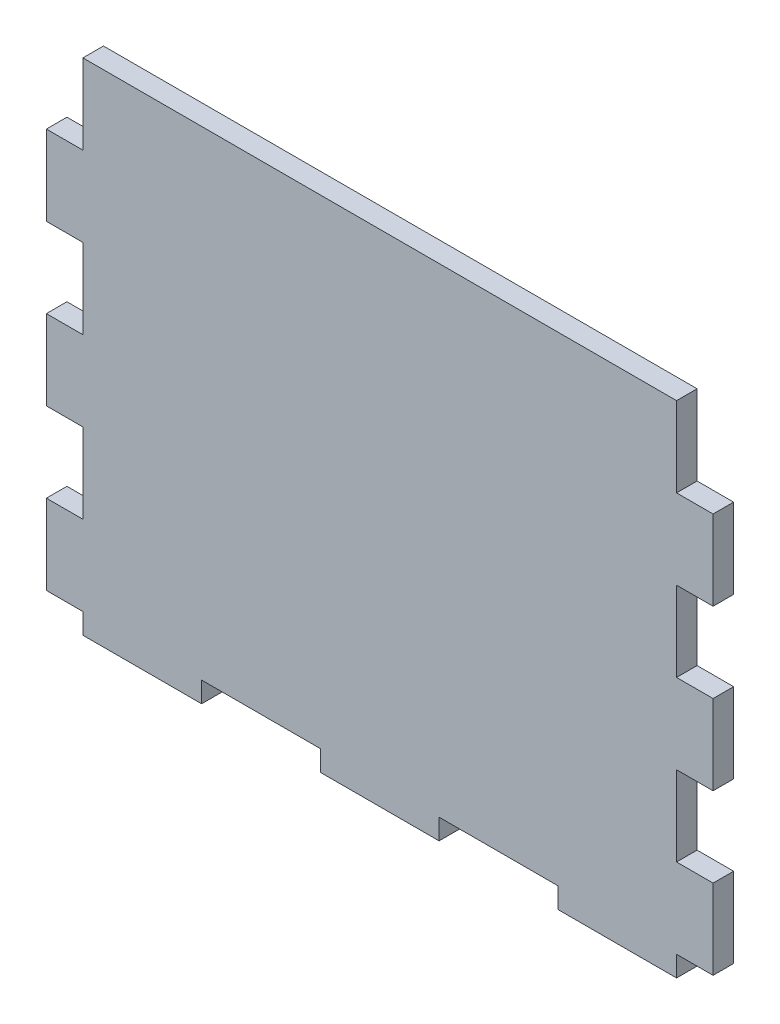
ISO-10303-21;
HEADER;
FILE_DESCRIPTION(('STEP AP214'),'2;1');
FILE_NAME('part.step','',(''),(''),'','','');
FILE_SCHEMA(('AUTOMOTIVE_DESIGN { 1 0 10303 214 1 1 1 1 }'));
ENDSEC;
DATA;
#1=APPLICATION_CONTEXT('core data for automotive mechanical design processes');
#2=APPLICATION_PROTOCOL_DEFINITION('international standard','automotive_design',2000,#1);
#3=PRODUCT_CONTEXT('',#1,'mechanical');
#4=PRODUCT('Part','Part','',(#3));
#5=PRODUCT_RELATED_PRODUCT_CATEGORY('part','',(#4));
#6=PRODUCT_DEFINITION_FORMATION('','',#4);
#7=PRODUCT_DEFINITION_CONTEXT('part definition',#1,'design');
#8=PRODUCT_DEFINITION('design','',#6,#7);
#9=PRODUCT_DEFINITION_SHAPE('','',#8);
#10=(LENGTH_UNIT() NAMED_UNIT(*) SI_UNIT(.MILLI.,.METRE.));
#11=(NAMED_UNIT(*) PLANE_ANGLE_UNIT() SI_UNIT($,.RADIAN.));
#12=(NAMED_UNIT(*) SI_UNIT($,.STERADIAN.) SOLID_ANGLE_UNIT());
#13=UNCERTAINTY_MEASURE_WITH_UNIT(LENGTH_MEASURE(1.E-05),#10,'distance_accuracy_value','');
#14=(GEOMETRIC_REPRESENTATION_CONTEXT(3) GLOBAL_UNCERTAINTY_ASSIGNED_CONTEXT((#13)) GLOBAL_UNIT_ASSIGNED_CONTEXT((#10,
#11,#12)) REPRESENTATION_CONTEXT('',''));
#15=CARTESIAN_POINT('',(0.,0.,0.));
#16=DIRECTION('',(0.,0.,1.));
#17=DIRECTION('',(1.,0.,0.));
#18=AXIS2_PLACEMENT_3D('',#15,#16,#17);
#19=CARTESIAN_POINT('',(0.,0.,2.25));
#20=DIRECTION('',(1.,0.,0.));
#21=DIRECTION('',(0.,0.,-1.));
#22=AXIS2_PLACEMENT_3D('',#19,#20,#21);
#23=PLANE('',#22);
#24=DIRECTION('',(0.,0.,1.));
#25=VECTOR('',#24,1.);
#26=CARTESIAN_POINT('',(-1.20058714961002E-13,35.,-13.1932748019588));
#27=LINE('',#26,#25);
#28=CARTESIAN_POINT('',(-1.20058714961002E-13,35.,0.));
#29=VERTEX_POINT('',#28);
#30=CARTESIAN_POINT('',(0.,35.,2.25));
#31=VERTEX_POINT('',#30);
#32=EDGE_CURVE('E1093',#29,#31,#27,.T.);
#33=ORIENTED_EDGE('',*,*,#32,.F.);
#34=DIRECTION('',(0.,-1.,0.));
#35=VECTOR('',#34,1.);
#36=CARTESIAN_POINT('',(0.,0.,0.));
#37=LINE('',#36,#35);
#38=CARTESIAN_POINT('',(0.,26.25,0.));
#39=VERTEX_POINT('',#38);
#40=EDGE_CURVE('E294',#29,#39,#37,.T.);
#41=ORIENTED_EDGE('',*,*,#40,.T.);
#42=DIRECTION('',(0.,0.,1.));
#43=VECTOR('',#42,1.);
#44=CARTESIAN_POINT('',(0.,26.25,-13.1932748019588));
#45=LINE('',#44,#43);
#46=CARTESIAN_POINT('',(0.,26.25,2.25));
#47=VERTEX_POINT('',#46);
#48=EDGE_CURVE('E315',#39,#47,#45,.T.);
#49=ORIENTED_EDGE('',*,*,#48,.T.);
#50=DIRECTION('',(0.,-1.,0.));
#51=VECTOR('',#50,1.);
#52=CARTESIAN_POINT('',(0.,0.,2.25));
#53=LINE('',#52,#51);
#54=EDGE_CURVE('E56',#31,#47,#53,.T.);
#55=ORIENTED_EDGE('',*,*,#54,.F.);
#56=EDGE_LOOP('',(#33,#41,#49,#55));
#57=FACE_BOUND('',#56,.T.);
#58=ADVANCED_FACE('F39',(#57),#23,.F.);
#59=CARTESIAN_POINT('',(0.,0.,2.25));
#60=DIRECTION('',(0.,1.,0.));
#61=DIRECTION('',(0.,0.,1.));
#62=AXIS2_PLACEMENT_3D('',#59,#60,#61);
#63=PLANE('',#62);
#64=DIRECTION('',(0.,0.,1.));
#65=VECTOR('',#64,1.);
#66=CARTESIAN_POINT('',(39.,0.,-13.1932748019588));
#67=LINE('',#66,#65);
#68=CARTESIAN_POINT('',(39.,0.,0.));
#69=VERTEX_POINT('',#68);
#70=CARTESIAN_POINT('',(39.,0.,2.25));
#71=VERTEX_POINT('',#70);
#72=EDGE_CURVE('E449',#69,#71,#67,.T.);
#73=ORIENTED_EDGE('',*,*,#72,.F.);
#74=DIRECTION('',(1.,0.,0.));
#75=VECTOR('',#74,1.);
#76=CARTESIAN_POINT('',(0.,0.,0.));
#77=LINE('',#76,#75);
#78=CARTESIAN_POINT('',(52.,0.,0.));
#79=VERTEX_POINT('',#78);
#80=EDGE_CURVE('E293',#69,#79,#77,.T.);
#81=ORIENTED_EDGE('',*,*,#80,.T.);
#82=DIRECTION('',(0.,0.,1.));
#83=VECTOR('',#82,1.);
#84=CARTESIAN_POINT('',(52.,0.,-13.1932748019588));
#85=LINE('',#84,#83);
#86=CARTESIAN_POINT('',(52.,0.,2.25));
#87=VERTEX_POINT('',#86);
#88=EDGE_CURVE('E446',#79,#87,#85,.T.);
#89=ORIENTED_EDGE('',*,*,#88,.T.);
#90=DIRECTION('',(1.,0.,0.));
#91=VECTOR('',#90,1.);
#92=CARTESIAN_POINT('',(0.,0.,2.25));
#93=LINE('',#92,#91);
#94=EDGE_CURVE('E433',#71,#87,#93,.T.);
#95=ORIENTED_EDGE('',*,*,#94,.F.);
#96=EDGE_LOOP('',(#73,#81,#89,#95));
#97=FACE_BOUND('',#96,.T.);
#98=ADVANCED_FACE('F445',(#97),#63,.F.);
#99=CARTESIAN_POINT('',(65.,0.,2.25));
#100=DIRECTION('',(-1.,0.,0.));
#101=DIRECTION('',(0.,0.,1.));
#102=AXIS2_PLACEMENT_3D('',#99,#100,#101);
#103=PLANE('',#102);
#104=DIRECTION('',(0.,0.,1.));
#105=VECTOR('',#104,1.);
#106=CARTESIAN_POINT('',(65.,8.75000000000001,-13.1932748019588));
#107=LINE('',#106,#105);
#108=CARTESIAN_POINT('',(65.,8.75000000000001,0.));
#109=VERTEX_POINT('',#108);
#110=CARTESIAN_POINT('',(65.,8.75000000000001,2.25));
#111=VERTEX_POINT('',#110);
#112=EDGE_CURVE('E599',#109,#111,#107,.T.);
#113=ORIENTED_EDGE('',*,*,#112,.F.);
#114=DIRECTION('',(0.,1.,0.));
#115=VECTOR('',#114,1.);
#116=CARTESIAN_POINT('',(65.,0.,0.));
#117=LINE('',#116,#115);
#118=CARTESIAN_POINT('',(65.,17.5,0.));
#119=VERTEX_POINT('',#118);
#120=EDGE_CURVE('E485',#109,#119,#117,.T.);
#121=ORIENTED_EDGE('',*,*,#120,.T.);
#122=DIRECTION('',(0.,0.,1.));
#123=VECTOR('',#122,1.);
#124=CARTESIAN_POINT('',(65.,17.5,-13.1932748019588));
#125=LINE('',#124,#123);
#126=CARTESIAN_POINT('',(65.,17.5,2.25));
#127=VERTEX_POINT('',#126);
#128=EDGE_CURVE('E359',#119,#127,#125,.T.);
#129=ORIENTED_EDGE('',*,*,#128,.T.);
#130=DIRECTION('',(0.,1.,0.));
#131=VECTOR('',#130,1.);
#132=CARTESIAN_POINT('',(65.,0.,2.25));
#133=LINE('',#132,#131);
#134=EDGE_CURVE('E47',#111,#127,#133,.T.);
#135=ORIENTED_EDGE('',*,*,#134,.F.);
#136=EDGE_LOOP('',(#113,#121,#129,#135));
#137=FACE_BOUND('',#136,.T.);
#138=ADVANCED_FACE('F528',(#137),#103,.F.);
#139=CARTESIAN_POINT('',(0.,52.5,0.));
#140=VERTEX_POINT('',#139);
#141=CARTESIAN_POINT('',(0.,43.75,0.));
#142=VERTEX_POINT('',#141);
#143=EDGE_CURVE('E289',#140,#142,#37,.T.);
#144=ORIENTED_EDGE('',*,*,#143,.T.);
#145=DIRECTION('',(0.,0.,1.));
#146=VECTOR('',#145,1.);
#147=CARTESIAN_POINT('',(-1.20058714961002E-13,43.75,-13.1932748019588));
#148=LINE('',#147,#146);
#149=CARTESIAN_POINT('',(0.,43.75,2.25));
#150=VERTEX_POINT('',#149);
#151=EDGE_CURVE('E64',#142,#150,#148,.T.);
#152=ORIENTED_EDGE('',*,*,#151,.T.);
#153=CARTESIAN_POINT('',(0.,52.5,2.25));
#154=VERTEX_POINT('',#153);
#155=EDGE_CURVE('E298',#154,#150,#53,.T.);
#156=ORIENTED_EDGE('',*,*,#155,.F.);
#157=DIRECTION('',(0.,0.,1.));
#158=VECTOR('',#157,1.);
#159=CARTESIAN_POINT('',(0.,52.5,-13.1932748019588));
#160=LINE('',#159,#158);
#161=EDGE_CURVE('E279',#140,#154,#160,.T.);
#162=ORIENTED_EDGE('',*,*,#161,.F.);
#163=EDGE_LOOP('',(#144,#152,#156,#162));
#164=FACE_BOUND('',#163,.T.);
#165=ADVANCED_FACE('F297',(#164),#23,.F.);
#166=DIRECTION('',(0.,0.,1.));
#167=VECTOR('',#166,1.);
#168=CARTESIAN_POINT('',(0.,17.5,-13.1932748019588));
#169=LINE('',#168,#167);
#170=CARTESIAN_POINT('',(0.,17.5,0.));
#171=VERTEX_POINT('',#170);
#172=CARTESIAN_POINT('',(0.,17.5,2.25));
#173=VERTEX_POINT('',#172);
#174=EDGE_CURVE('E312',#171,#173,#169,.T.);
#175=ORIENTED_EDGE('',*,*,#174,.F.);
#176=CARTESIAN_POINT('',(0.,8.75000000000001,0.));
#177=VERTEX_POINT('',#176);
#178=EDGE_CURVE('E296',#171,#177,#37,.T.);
#179=ORIENTED_EDGE('',*,*,#178,.T.);
#180=DIRECTION('',(0.,0.,1.));
#181=VECTOR('',#180,1.);
#182=CARTESIAN_POINT('',(0.,8.75000000000001,-13.1932748019588));
#183=LINE('',#182,#181);
#184=CARTESIAN_POINT('',(0.,8.75000000000001,2.25));
#185=VERTEX_POINT('',#184);
#186=EDGE_CURVE('E361',#177,#185,#183,.T.);
#187=ORIENTED_EDGE('',*,*,#186,.T.);
#188=EDGE_CURVE('E429',#173,#185,#53,.T.);
#189=ORIENTED_EDGE('',*,*,#188,.F.);
#190=EDGE_LOOP('',(#175,#179,#187,#189));
#191=FACE_BOUND('',#190,.T.);
#192=ADVANCED_FACE('F524',(#191),#23,.F.);
#193=CARTESIAN_POINT('',(13.,0.,0.));
#194=VERTEX_POINT('',#193);
#195=CARTESIAN_POINT('',(26.,0.,0.));
#196=VERTEX_POINT('',#195);
#197=EDGE_CURVE('E436',#194,#196,#77,.T.);
#198=ORIENTED_EDGE('',*,*,#197,.T.);
#199=DIRECTION('',(0.,0.,1.));
#200=VECTOR('',#199,1.);
#201=CARTESIAN_POINT('',(26.,0.,-13.1932748019588));
#202=LINE('',#201,#200);
#203=CARTESIAN_POINT('',(26.,0.,2.25));
#204=VERTEX_POINT('',#203);
#205=EDGE_CURVE('E576',#196,#204,#202,.T.);
#206=ORIENTED_EDGE('',*,*,#205,.T.);
#207=CARTESIAN_POINT('',(13.,0.,2.25));
#208=VERTEX_POINT('',#207);
#209=EDGE_CURVE('E432',#208,#204,#93,.T.);
#210=ORIENTED_EDGE('',*,*,#209,.F.);
#211=DIRECTION('',(0.,0.,1.));
#212=VECTOR('',#211,1.);
#213=CARTESIAN_POINT('',(13.,0.,-13.1932748019588));
#214=LINE('',#213,#212);
#215=EDGE_CURVE('E310',#194,#208,#214,.T.);
#216=ORIENTED_EDGE('',*,*,#215,.F.);
#217=EDGE_LOOP('',(#198,#206,#210,#216));
#218=FACE_BOUND('',#217,.T.);
#219=ADVANCED_FACE('F529',(#218),#63,.F.);
#220=DIRECTION('',(0.,0.,1.));
#221=VECTOR('',#220,1.);
#222=CARTESIAN_POINT('',(65.,26.25,-13.1932748019588));
#223=LINE('',#222,#221);
#224=CARTESIAN_POINT('',(65.,26.25,0.));
#225=VERTEX_POINT('',#224);
#226=CARTESIAN_POINT('',(65.,26.25,2.25));
#227=VERTEX_POINT('',#226);
#228=EDGE_CURVE('E384',#225,#227,#223,.T.);
#229=ORIENTED_EDGE('',*,*,#228,.F.);
#230=CARTESIAN_POINT('',(65.,35.,0.));
#231=VERTEX_POINT('',#230);
#232=EDGE_CURVE('E440',#225,#231,#117,.T.);
#233=ORIENTED_EDGE('',*,*,#232,.T.);
#234=DIRECTION('',(0.,0.,1.));
#235=VECTOR('',#234,1.);
#236=CARTESIAN_POINT('',(65.,35.,-13.1932748019588));
#237=LINE('',#236,#235);
#238=CARTESIAN_POINT('',(65.,35.,2.25));
#239=VERTEX_POINT('',#238);
#240=EDGE_CURVE('E405',#231,#239,#237,.T.);
#241=ORIENTED_EDGE('',*,*,#240,.T.);
#242=EDGE_CURVE('E505',#227,#239,#133,.T.);
#243=ORIENTED_EDGE('',*,*,#242,.F.);
#244=EDGE_LOOP('',(#229,#233,#241,#243));
#245=FACE_BOUND('',#244,.T.);
#246=ADVANCED_FACE('F495',(#245),#103,.F.);
#247=CARTESIAN_POINT('',(65.,43.75,0.));
#248=VERTEX_POINT('',#247);
#249=CARTESIAN_POINT('',(65.,52.5,0.));
#250=VERTEX_POINT('',#249);
#251=EDGE_CURVE('E435',#248,#250,#117,.T.);
#252=ORIENTED_EDGE('',*,*,#251,.T.);
#253=DIRECTION('',(0.,0.,1.));
#254=VECTOR('',#253,1.);
#255=CARTESIAN_POINT('',(65.0000000000002,52.5,-13.1932748019588));
#256=LINE('',#255,#254);
#257=CARTESIAN_POINT('',(65.0000000000002,52.5,2.25));
#258=VERTEX_POINT('',#257);
#259=EDGE_CURVE('E282',#250,#258,#256,.T.);
#260=ORIENTED_EDGE('',*,*,#259,.T.);
#261=CARTESIAN_POINT('',(65.,43.75,2.25));
#262=VERTEX_POINT('',#261);
#263=EDGE_CURVE('E49',#262,#258,#133,.T.);
#264=ORIENTED_EDGE('',*,*,#263,.F.);
#265=DIRECTION('',(0.,0.,1.));
#266=VECTOR('',#265,1.);
#267=CARTESIAN_POINT('',(65.,43.75,-13.1932748019588));
#268=LINE('',#267,#266);
#269=EDGE_CURVE('E406',#248,#262,#268,.T.);
#270=ORIENTED_EDGE('',*,*,#269,.F.);
#271=EDGE_LOOP('',(#252,#260,#264,#270));
#272=FACE_BOUND('',#271,.T.);
#273=ADVANCED_FACE('F507',(#272),#103,.F.);
#274=CARTESIAN_POINT('',(-4.,0.,0.));
#275=VERTEX_POINT('',#274);
#276=CARTESIAN_POINT('',(0.,0.,0.));
#277=VERTEX_POINT('',#276);
#278=EDGE_CURVE('E434',#275,#277,#77,.T.);
#279=ORIENTED_EDGE('',*,*,#278,.T.);
#280=DIRECTION('',(0.,0.,1.));
#281=VECTOR('',#280,1.);
#282=CARTESIAN_POINT('',(0.,0.,-13.1932748019588));
#283=LINE('',#282,#281);
#284=CARTESIAN_POINT('',(0.,0.,2.25));
#285=VERTEX_POINT('',#284);
#286=EDGE_CURVE('E331',#277,#285,#283,.T.);
#287=ORIENTED_EDGE('',*,*,#286,.T.);
#288=CARTESIAN_POINT('',(-4.,0.,2.25));
#289=VERTEX_POINT('',#288);
#290=EDGE_CURVE('E430',#289,#285,#93,.T.);
#291=ORIENTED_EDGE('',*,*,#290,.F.);
#292=DIRECTION('',(0.,0.,1.));
#293=VECTOR('',#292,1.);
#294=CARTESIAN_POINT('',(-4.,0.,-13.1932748019588));
#295=LINE('',#294,#293);
#296=EDGE_CURVE('E356',#275,#289,#295,.T.);
#297=ORIENTED_EDGE('',*,*,#296,.F.);
#298=EDGE_LOOP('',(#279,#287,#291,#297));
#299=FACE_BOUND('',#298,.T.);
#300=ADVANCED_FACE('F530',(#299),#63,.F.);
#301=CARTESIAN_POINT('',(65.,-2.25,0.));
#302=VERTEX_POINT('',#301);
#303=CARTESIAN_POINT('',(65.,0.,0.));
#304=VERTEX_POINT('',#303);
#305=EDGE_CURVE('E42',#302,#304,#117,.T.);
#306=ORIENTED_EDGE('',*,*,#305,.T.);
#307=DIRECTION('',(0.,0.,1.));
#308=VECTOR('',#307,1.);
#309=CARTESIAN_POINT('',(65.,0.,-13.1932748019588));
#310=LINE('',#309,#308);
#311=CARTESIAN_POINT('',(65.,0.,2.25));
#312=VERTEX_POINT('',#311);
#313=EDGE_CURVE('E471',#304,#312,#310,.T.);
#314=ORIENTED_EDGE('',*,*,#313,.T.);
#315=CARTESIAN_POINT('',(65.,-2.25,2.25));
#316=VERTEX_POINT('',#315);
#317=EDGE_CURVE('E11',#316,#312,#133,.T.);
#318=ORIENTED_EDGE('',*,*,#317,.F.);
#319=DIRECTION('',(0.,0.,1.));
#320=VECTOR('',#319,1.);
#321=CARTESIAN_POINT('',(65.,-2.25,-13.1932748019588));
#322=LINE('',#321,#320);
#323=EDGE_CURVE('E462',#302,#316,#322,.T.);
#324=ORIENTED_EDGE('',*,*,#323,.F.);
#325=EDGE_LOOP('',(#306,#314,#318,#324));
#326=FACE_BOUND('',#325,.T.);
#327=ADVANCED_FACE('F867',(#326),#103,.F.);
#328=CARTESIAN_POINT('',(0.,0.,2.25));
#329=DIRECTION('',(0.,0.,-1.));
#330=DIRECTION('',(-1.,0.,0.));
#331=AXIS2_PLACEMENT_3D('',#328,#329,#330);
#332=PLANE('',#331);
#333=ORIENTED_EDGE('',*,*,#263,.T.);
#334=DIRECTION('',(-1.,0.,0.));
#335=VECTOR('',#334,1.);
#336=CARTESIAN_POINT('',(69.0000000000001,52.5,2.25));
#337=LINE('',#336,#335);
#338=EDGE_CURVE('E286',#258,#154,#337,.T.);
#339=ORIENTED_EDGE('',*,*,#338,.T.);
#340=ORIENTED_EDGE('',*,*,#155,.T.);
#341=DIRECTION('',(-1.,0.,0.));
#342=VECTOR('',#341,1.);
#343=CARTESIAN_POINT('',(-1.20058714961002E-13,43.75,2.25));
#344=LINE('',#343,#342);
#345=CARTESIAN_POINT('',(-4.00000000000015,43.75,2.25));
#346=VERTEX_POINT('',#345);
#347=EDGE_CURVE('E1101',#150,#346,#344,.T.);
#348=ORIENTED_EDGE('',*,*,#347,.T.);
#349=DIRECTION('',(0.,1.,0.));
#350=VECTOR('',#349,1.);
#351=CARTESIAN_POINT('',(-4.00000000000012,35.,2.25));
#352=LINE('',#351,#350);
#353=CARTESIAN_POINT('',(-4.00000000000012,35.,2.25));
#354=VERTEX_POINT('',#353);
#355=EDGE_CURVE('E1107',#354,#346,#352,.T.);
#356=ORIENTED_EDGE('',*,*,#355,.F.);
#357=DIRECTION('',(-1.,0.,0.));
#358=VECTOR('',#357,1.);
#359=CARTESIAN_POINT('',(-1.20058714961002E-13,35.,2.25));
#360=LINE('',#359,#358);
#361=EDGE_CURVE('E1105',#31,#354,#360,.T.);
#362=ORIENTED_EDGE('',*,*,#361,.F.);
#363=ORIENTED_EDGE('',*,*,#54,.T.);
#364=DIRECTION('',(-1.,0.,0.));
#365=VECTOR('',#364,1.);
#366=CARTESIAN_POINT('',(0.,26.25,2.25));
#367=LINE('',#366,#365);
#368=CARTESIAN_POINT('',(-4.00000000000009,26.25,2.25));
#369=VERTEX_POINT('',#368);
#370=EDGE_CURVE('E322',#47,#369,#367,.T.);
#371=ORIENTED_EDGE('',*,*,#370,.T.);
#372=DIRECTION('',(0.,1.,0.));
#373=VECTOR('',#372,1.);
#374=CARTESIAN_POINT('',(-4.,0.,2.25));
#375=LINE('',#374,#373);
#376=CARTESIAN_POINT('',(-4.00000000000006,17.5,2.25));
#377=VERTEX_POINT('',#376);
#378=EDGE_CURVE('E311',#377,#369,#375,.T.);
#379=ORIENTED_EDGE('',*,*,#378,.F.);
#380=DIRECTION('',(-1.,0.,0.));
#381=VECTOR('',#380,1.);
#382=CARTESIAN_POINT('',(0.,17.5,2.25));
#383=LINE('',#382,#381);
#384=EDGE_CURVE('E316',#173,#377,#383,.T.);
#385=ORIENTED_EDGE('',*,*,#384,.F.);
#386=ORIENTED_EDGE('',*,*,#188,.T.);
#387=DIRECTION('',(-1.,0.,0.));
#388=VECTOR('',#387,1.);
#389=CARTESIAN_POINT('',(0.,8.75000000000001,2.25));
#390=LINE('',#389,#388);
#391=CARTESIAN_POINT('',(-4.00000000000003,8.75,2.25));
#392=VERTEX_POINT('',#391);
#393=EDGE_CURVE('E365',#185,#392,#390,.T.);
#394=ORIENTED_EDGE('',*,*,#393,.T.);
#395=DIRECTION('',(0.,1.,0.));
#396=VECTOR('',#395,1.);
#397=CARTESIAN_POINT('',(-4.,0.,2.25));
#398=LINE('',#397,#396);
#399=EDGE_CURVE('E360',#289,#392,#398,.T.);
#400=ORIENTED_EDGE('',*,*,#399,.F.);
#401=ORIENTED_EDGE('',*,*,#290,.T.);
#402=DIRECTION('',(0.,-1.,0.));
#403=VECTOR('',#402,1.);
#404=CARTESIAN_POINT('',(0.,0.,2.25));
#405=LINE('',#404,#403);
#406=CARTESIAN_POINT('',(0.,-2.25,2.25));
#407=VERTEX_POINT('',#406);
#408=EDGE_CURVE('E333',#285,#407,#405,.T.);
#409=ORIENTED_EDGE('',*,*,#408,.T.);
#410=DIRECTION('',(1.,0.,0.));
#411=VECTOR('',#410,1.);
#412=CARTESIAN_POINT('',(0.,-2.25,2.25));
#413=LINE('',#412,#411);
#414=CARTESIAN_POINT('',(13.,-2.25,2.25));
#415=VERTEX_POINT('',#414);
#416=EDGE_CURVE('E347',#407,#415,#413,.T.);
#417=ORIENTED_EDGE('',*,*,#416,.T.);
#418=DIRECTION('',(0.,-1.,0.));
#419=VECTOR('',#418,1.);
#420=CARTESIAN_POINT('',(13.,0.,2.25));
#421=LINE('',#420,#419);
#422=EDGE_CURVE('E337',#208,#415,#421,.T.);
#423=ORIENTED_EDGE('',*,*,#422,.F.);
#424=ORIENTED_EDGE('',*,*,#209,.T.);
#425=DIRECTION('',(0.,-1.,0.));
#426=VECTOR('',#425,1.);
#427=CARTESIAN_POINT('',(26.,0.,2.25));
#428=LINE('',#427,#426);
#429=CARTESIAN_POINT('',(26.,-2.25,2.25));
#430=VERTEX_POINT('',#429);
#431=EDGE_CURVE('E571',#204,#430,#428,.T.);
#432=ORIENTED_EDGE('',*,*,#431,.T.);
#433=DIRECTION('',(1.,0.,0.));
#434=VECTOR('',#433,1.);
#435=CARTESIAN_POINT('',(26.,-2.25,2.25));
#436=LINE('',#435,#434);
#437=CARTESIAN_POINT('',(39.,-2.25,2.25));
#438=VERTEX_POINT('',#437);
#439=EDGE_CURVE('E581',#430,#438,#436,.T.);
#440=ORIENTED_EDGE('',*,*,#439,.T.);
#441=DIRECTION('',(0.,-1.,0.));
#442=VECTOR('',#441,1.);
#443=CARTESIAN_POINT('',(39.,0.,2.25));
#444=LINE('',#443,#442);
#445=EDGE_CURVE('E479',#71,#438,#444,.T.);
#446=ORIENTED_EDGE('',*,*,#445,.F.);
#447=ORIENTED_EDGE('',*,*,#94,.T.);
#448=DIRECTION('',(0.,-1.,0.));
#449=VECTOR('',#448,1.);
#450=CARTESIAN_POINT('',(52.,0.,2.25));
#451=LINE('',#450,#449);
#452=CARTESIAN_POINT('',(52.,-2.25,2.25));
#453=VERTEX_POINT('',#452);
#454=EDGE_CURVE('E457',#87,#453,#451,.T.);
#455=ORIENTED_EDGE('',*,*,#454,.T.);
#456=DIRECTION('',(1.,0.,0.));
#457=VECTOR('',#456,1.);
#458=CARTESIAN_POINT('',(52.,-2.25,2.25));
#459=LINE('',#458,#457);
#460=EDGE_CURVE('E469',#453,#316,#459,.T.);
#461=ORIENTED_EDGE('',*,*,#460,.T.);
#462=ORIENTED_EDGE('',*,*,#317,.T.);
#463=DIRECTION('',(1.,0.,0.));
#464=VECTOR('',#463,1.);
#465=CARTESIAN_POINT('',(0.,0.,2.25));
#466=LINE('',#465,#464);
#467=CARTESIAN_POINT('',(69.,0.,2.25));
#468=VERTEX_POINT('',#467);
#469=EDGE_CURVE('E605',#312,#468,#466,.T.);
#470=ORIENTED_EDGE('',*,*,#469,.T.);
#471=DIRECTION('',(0.,1.,0.));
#472=VECTOR('',#471,1.);
#473=CARTESIAN_POINT('',(69.,-2.18872539140388E-13,2.25));
#474=LINE('',#473,#472);
#475=CARTESIAN_POINT('',(69.,8.75,2.25));
#476=VERTEX_POINT('',#475);
#477=EDGE_CURVE('E608',#468,#476,#474,.T.);
#478=ORIENTED_EDGE('',*,*,#477,.T.);
#479=DIRECTION('',(1.,0.,0.));
#480=VECTOR('',#479,1.);
#481=CARTESIAN_POINT('',(0.,8.75000000000012,2.25));
#482=LINE('',#481,#480);
#483=EDGE_CURVE('E592',#111,#476,#482,.T.);
#484=ORIENTED_EDGE('',*,*,#483,.F.);
#485=ORIENTED_EDGE('',*,*,#134,.T.);
#486=DIRECTION('',(1.,0.,0.));
#487=VECTOR('',#486,1.);
#488=CARTESIAN_POINT('',(0.,17.4999999999998,2.25));
#489=LINE('',#488,#487);
#490=CARTESIAN_POINT('',(69.0000000000001,17.5,2.25));
#491=VERTEX_POINT('',#490);
#492=EDGE_CURVE('E392',#127,#491,#489,.T.);
#493=ORIENTED_EDGE('',*,*,#492,.T.);
#494=DIRECTION('',(0.,1.,0.));
#495=VECTOR('',#494,1.);
#496=CARTESIAN_POINT('',(69.,-2.18872539140388E-13,2.25));
#497=LINE('',#496,#495);
#498=CARTESIAN_POINT('',(69.0000000000001,26.25,2.25));
#499=VERTEX_POINT('',#498);
#500=EDGE_CURVE('E395',#491,#499,#497,.T.);
#501=ORIENTED_EDGE('',*,*,#500,.T.);
#502=DIRECTION('',(1.,0.,0.));
#503=VECTOR('',#502,1.);
#504=CARTESIAN_POINT('',(0.,26.2499999999999,2.25));
#505=LINE('',#504,#503);
#506=EDGE_CURVE('E377',#227,#499,#505,.T.);
#507=ORIENTED_EDGE('',*,*,#506,.F.);
#508=ORIENTED_EDGE('',*,*,#242,.T.);
#509=DIRECTION('',(1.,0.,0.));
#510=VECTOR('',#509,1.);
#511=CARTESIAN_POINT('',(-2.42861286636749E-13,34.9999999999995,2.25));
#512=LINE('',#511,#510);
#513=CARTESIAN_POINT('',(69.0000000000001,35.,2.25));
#514=VERTEX_POINT('',#513);
#515=EDGE_CURVE('E411',#239,#514,#512,.T.);
#516=ORIENTED_EDGE('',*,*,#515,.T.);
#517=DIRECTION('',(0.,1.,0.));
#518=VECTOR('',#517,1.);
#519=CARTESIAN_POINT('',(69.0000000000001,-1.09436269570194E-13,2.25));
#520=LINE('',#519,#518);
#521=CARTESIAN_POINT('',(69.0000000000001,43.75,2.25));
#522=VERTEX_POINT('',#521);
#523=EDGE_CURVE('E407',#514,#522,#520,.T.);
#524=ORIENTED_EDGE('',*,*,#523,.T.);
#525=DIRECTION('',(1.,0.,0.));
#526=VECTOR('',#525,1.);
#527=CARTESIAN_POINT('',(-1.51788304147969E-13,43.7499999999998,2.25));
#528=LINE('',#527,#526);
#529=EDGE_CURVE('E402',#262,#522,#528,.T.);
#530=ORIENTED_EDGE('',*,*,#529,.F.);
#531=EDGE_LOOP('',(#333,#339,#340,#348,#356,#362,#363,#371,#379,#385,#386,#394,#400,#401,#409,
#417,#423,#424,#432,#440,#446,#447,#455,#461,#462,#470,#478,#484,#485,#493,#501,#507,#508,#516,
#524,#530));
#532=FACE_BOUND('',#531,.T.);
#533=ADVANCED_FACE('F474',(#532),#332,.F.);
#534=CARTESIAN_POINT('',(0.,0.,0.));
#535=DIRECTION('',(0.,0.,-1.));
#536=DIRECTION('',(-1.,0.,0.));
#537=AXIS2_PLACEMENT_3D('',#534,#535,#536);
#538=PLANE('',#537);
#539=DIRECTION('',(-1.,0.,0.));
#540=VECTOR('',#539,1.);
#541=CARTESIAN_POINT('',(69.0000000000001,52.5,0.));
#542=LINE('',#541,#540);
#543=EDGE_CURVE('E275',#250,#140,#542,.T.);
#544=ORIENTED_EDGE('',*,*,#543,.F.);
#545=ORIENTED_EDGE('',*,*,#251,.F.);
#546=DIRECTION('',(1.,0.,0.));
#547=VECTOR('',#546,1.);
#548=CARTESIAN_POINT('',(-1.51788304147969E-13,43.7499999999998,0.));
#549=LINE('',#548,#547);
#550=CARTESIAN_POINT('',(69.0000000000001,43.75,0.));
#551=VERTEX_POINT('',#550);
#552=EDGE_CURVE('E391',#248,#551,#549,.T.);
#553=ORIENTED_EDGE('',*,*,#552,.T.);
#554=DIRECTION('',(0.,1.,0.));
#555=VECTOR('',#554,1.);
#556=CARTESIAN_POINT('',(69.0000000000001,-1.09436269570194E-13,0.));
#557=LINE('',#556,#555);
#558=CARTESIAN_POINT('',(69.0000000000001,35.,0.));
#559=VERTEX_POINT('',#558);
#560=EDGE_CURVE('E418',#559,#551,#557,.T.);
#561=ORIENTED_EDGE('',*,*,#560,.F.);
#562=DIRECTION('',(1.,0.,0.));
#563=VECTOR('',#562,1.);
#564=CARTESIAN_POINT('',(-2.42861286636749E-13,34.9999999999995,0.));
#565=LINE('',#564,#563);
#566=EDGE_CURVE('E410',#231,#559,#565,.T.);
#567=ORIENTED_EDGE('',*,*,#566,.F.);
#568=ORIENTED_EDGE('',*,*,#232,.F.);
#569=DIRECTION('',(1.,0.,0.));
#570=VECTOR('',#569,1.);
#571=CARTESIAN_POINT('',(0.,26.2499999999999,0.));
#572=LINE('',#571,#570);
#573=CARTESIAN_POINT('',(69.0000000000001,26.25,0.));
#574=VERTEX_POINT('',#573);
#575=EDGE_CURVE('E389',#225,#574,#572,.T.);
#576=ORIENTED_EDGE('',*,*,#575,.T.);
#577=DIRECTION('',(0.,1.,0.));
#578=VECTOR('',#577,1.);
#579=CARTESIAN_POINT('',(69.,-2.18872539140388E-13,0.));
#580=LINE('',#579,#578);
#581=CARTESIAN_POINT('',(69.0000000000001,17.5,0.));
#582=VERTEX_POINT('',#581);
#583=EDGE_CURVE('E381',#582,#574,#580,.T.);
#584=ORIENTED_EDGE('',*,*,#583,.F.);
#585=DIRECTION('',(1.,0.,0.));
#586=VECTOR('',#585,1.);
#587=CARTESIAN_POINT('',(0.,17.4999999999998,0.));
#588=LINE('',#587,#586);
#589=EDGE_CURVE('E380',#119,#582,#588,.T.);
#590=ORIENTED_EDGE('',*,*,#589,.F.);
#591=ORIENTED_EDGE('',*,*,#120,.F.);
#592=DIRECTION('',(1.,0.,0.));
#593=VECTOR('',#592,1.);
#594=CARTESIAN_POINT('',(0.,8.75000000000012,0.));
#595=LINE('',#594,#593);
#596=CARTESIAN_POINT('',(69.,8.75,0.));
#597=VERTEX_POINT('',#596);
#598=EDGE_CURVE('E583',#109,#597,#595,.T.);
#599=ORIENTED_EDGE('',*,*,#598,.T.);
#600=DIRECTION('',(0.,1.,0.));
#601=VECTOR('',#600,1.);
#602=CARTESIAN_POINT('',(69.,-2.18872539140388E-13,0.));
#603=LINE('',#602,#601);
#604=CARTESIAN_POINT('',(69.,0.,0.));
#605=VERTEX_POINT('',#604);
#606=EDGE_CURVE('E595',#605,#597,#603,.T.);
#607=ORIENTED_EDGE('',*,*,#606,.F.);
#608=DIRECTION('',(1.,0.,0.));
#609=VECTOR('',#608,1.);
#610=CARTESIAN_POINT('',(0.,0.,0.));
#611=LINE('',#610,#609);
#612=EDGE_CURVE('E596',#304,#605,#611,.T.);
#613=ORIENTED_EDGE('',*,*,#612,.F.);
#614=ORIENTED_EDGE('',*,*,#305,.F.);
#615=DIRECTION('',(1.,0.,0.));
#616=VECTOR('',#615,1.);
#617=CARTESIAN_POINT('',(52.,-2.25,0.));
#618=LINE('',#617,#616);
#619=CARTESIAN_POINT('',(52.,-2.25,0.));
#620=VERTEX_POINT('',#619);
#621=EDGE_CURVE('E304',#620,#302,#618,.T.);
#622=ORIENTED_EDGE('',*,*,#621,.F.);
#623=DIRECTION('',(0.,-1.,0.));
#624=VECTOR('',#623,1.);
#625=CARTESIAN_POINT('',(52.,0.,0.));
#626=LINE('',#625,#624);
#627=EDGE_CURVE('E454',#79,#620,#626,.T.);
#628=ORIENTED_EDGE('',*,*,#627,.F.);
#629=ORIENTED_EDGE('',*,*,#80,.F.);
#630=DIRECTION('',(0.,-1.,0.));
#631=VECTOR('',#630,1.);
#632=CARTESIAN_POINT('',(39.,0.,0.));
#633=LINE('',#632,#631);
#634=CARTESIAN_POINT('',(39.,-2.25,0.));
#635=VERTEX_POINT('',#634);
#636=EDGE_CURVE('E580',#69,#635,#633,.T.);
#637=ORIENTED_EDGE('',*,*,#636,.T.);
#638=DIRECTION('',(1.,0.,0.));
#639=VECTOR('',#638,1.);
#640=CARTESIAN_POINT('',(26.,-2.25,0.));
#641=LINE('',#640,#639);
#642=CARTESIAN_POINT('',(26.,-2.25,0.));
#643=VERTEX_POINT('',#642);
#644=EDGE_CURVE('E585',#643,#635,#641,.T.);
#645=ORIENTED_EDGE('',*,*,#644,.F.);
#646=DIRECTION('',(0.,-1.,0.));
#647=VECTOR('',#646,1.);
#648=CARTESIAN_POINT('',(26.,0.,0.));
#649=LINE('',#648,#647);
#650=EDGE_CURVE('E1099',#196,#643,#649,.T.);
#651=ORIENTED_EDGE('',*,*,#650,.F.);
#652=ORIENTED_EDGE('',*,*,#197,.F.);
#653=DIRECTION('',(0.,-1.,0.));
#654=VECTOR('',#653,1.);
#655=CARTESIAN_POINT('',(13.,0.,0.));
#656=LINE('',#655,#654);
#657=CARTESIAN_POINT('',(13.,-2.25,0.));
#658=VERTEX_POINT('',#657);
#659=EDGE_CURVE('E343',#194,#658,#656,.T.);
#660=ORIENTED_EDGE('',*,*,#659,.T.);
#661=DIRECTION('',(1.,0.,0.));
#662=VECTOR('',#661,1.);
#663=CARTESIAN_POINT('',(0.,-2.25,0.));
#664=LINE('',#663,#662);
#665=CARTESIAN_POINT('',(0.,-2.25,0.));
#666=VERTEX_POINT('',#665);
#667=EDGE_CURVE('E342',#666,#658,#664,.T.);
#668=ORIENTED_EDGE('',*,*,#667,.F.);
#669=DIRECTION('',(0.,-1.,0.));
#670=VECTOR('',#669,1.);
#671=CARTESIAN_POINT('',(0.,0.,0.));
#672=LINE('',#671,#670);
#673=EDGE_CURVE('E339',#277,#666,#672,.T.);
#674=ORIENTED_EDGE('',*,*,#673,.F.);
#675=ORIENTED_EDGE('',*,*,#278,.F.);
#676=DIRECTION('',(0.,1.,0.));
#677=VECTOR('',#676,1.);
#678=CARTESIAN_POINT('',(-4.,0.,0.));
#679=LINE('',#678,#677);
#680=CARTESIAN_POINT('',(-4.00000000000003,8.75,0.));
#681=VERTEX_POINT('',#680);
#682=EDGE_CURVE('E346',#275,#681,#679,.T.);
#683=ORIENTED_EDGE('',*,*,#682,.T.);
#684=DIRECTION('',(-1.,0.,0.));
#685=VECTOR('',#684,1.);
#686=CARTESIAN_POINT('',(0.,8.75000000000001,0.));
#687=LINE('',#686,#685);
#688=EDGE_CURVE('E367',#177,#681,#687,.T.);
#689=ORIENTED_EDGE('',*,*,#688,.F.);
#690=ORIENTED_EDGE('',*,*,#178,.F.);
#691=DIRECTION('',(-1.,0.,0.));
#692=VECTOR('',#691,1.);
#693=CARTESIAN_POINT('',(0.,17.5,0.));
#694=LINE('',#693,#692);
#695=CARTESIAN_POINT('',(-4.00000000000006,17.5,0.));
#696=VERTEX_POINT('',#695);
#697=EDGE_CURVE('E302',#171,#696,#694,.T.);
#698=ORIENTED_EDGE('',*,*,#697,.T.);
#699=DIRECTION('',(0.,1.,0.));
#700=VECTOR('',#699,1.);
#701=CARTESIAN_POINT('',(-4.,0.,0.));
#702=LINE('',#701,#700);
#703=CARTESIAN_POINT('',(-4.00000000000009,26.25,0.));
#704=VERTEX_POINT('',#703);
#705=EDGE_CURVE('E299',#696,#704,#702,.T.);
#706=ORIENTED_EDGE('',*,*,#705,.T.);
#707=DIRECTION('',(-1.,0.,0.));
#708=VECTOR('',#707,1.);
#709=CARTESIAN_POINT('',(0.,26.25,0.));
#710=LINE('',#709,#708);
#711=EDGE_CURVE('E320',#39,#704,#710,.T.);
#712=ORIENTED_EDGE('',*,*,#711,.F.);
#713=ORIENTED_EDGE('',*,*,#40,.F.);
#714=DIRECTION('',(-1.,0.,0.));
#715=VECTOR('',#714,1.);
#716=CARTESIAN_POINT('',(-1.20058714961002E-13,35.,0.));
#717=LINE('',#716,#715);
#718=CARTESIAN_POINT('',(-4.00000000000012,35.,0.));
#719=VERTEX_POINT('',#718);
#720=EDGE_CURVE('E1091',#29,#719,#717,.T.);
#721=ORIENTED_EDGE('',*,*,#720,.T.);
#722=DIRECTION('',(0.,1.,0.));
#723=VECTOR('',#722,1.);
#724=CARTESIAN_POINT('',(-4.00000000000012,35.,0.));
#725=LINE('',#724,#723);
#726=CARTESIAN_POINT('',(-4.00000000000015,43.75,0.));
#727=VERTEX_POINT('',#726);
#728=EDGE_CURVE('E1097',#719,#727,#725,.T.);
#729=ORIENTED_EDGE('',*,*,#728,.T.);
#730=DIRECTION('',(-1.,0.,0.));
#731=VECTOR('',#730,1.);
#732=CARTESIAN_POINT('',(-1.20058714961002E-13,43.75,0.));
#733=LINE('',#732,#731);
#734=EDGE_CURVE('E292',#142,#727,#733,.T.);
#735=ORIENTED_EDGE('',*,*,#734,.F.);
#736=ORIENTED_EDGE('',*,*,#143,.F.);
#737=EDGE_LOOP('',(#544,#545,#553,#561,#567,#568,#576,#584,#590,#591,#599,#607,#613,#614,#622,
#628,#629,#637,#645,#651,#652,#660,#668,#674,#675,#683,#689,#690,#698,#706,#712,#713,#721,#729,
#735,#736));
#738=FACE_BOUND('',#737,.T.);
#739=ADVANCED_FACE('F290',(#738),#538,.T.);
#740=CARTESIAN_POINT('',(-2.42861286636749E-13,34.9999999999995,-13.1932748019588));
#741=DIRECTION('',(0.,-1.,0.));
#742=DIRECTION('',(1.,0.,0.));
#743=AXIS2_PLACEMENT_3D('',#740,#741,#742);
#744=PLANE('',#743);
#745=ORIENTED_EDGE('',*,*,#240,.F.);
#746=ORIENTED_EDGE('',*,*,#566,.T.);
#747=DIRECTION('',(0.,0.,1.));
#748=VECTOR('',#747,1.);
#749=CARTESIAN_POINT('',(69.0000000000001,35.,-13.1932748019588));
#750=LINE('',#749,#748);
#751=EDGE_CURVE('E416',#559,#514,#750,.T.);
#752=ORIENTED_EDGE('',*,*,#751,.T.);
#753=ORIENTED_EDGE('',*,*,#515,.F.);
#754=EDGE_LOOP('',(#745,#746,#752,#753));
#755=FACE_BOUND('',#754,.T.);
#756=ADVANCED_FACE('F501',(#755),#744,.T.);
#757=CARTESIAN_POINT('',(69.0000000000001,-1.09436269570194E-13,-13.1932748019588));
#758=DIRECTION('',(1.,0.,0.));
#759=DIRECTION('',(0.,1.,0.));
#760=AXIS2_PLACEMENT_3D('',#757,#758,#759);
#761=PLANE('',#760);
#762=ORIENTED_EDGE('',*,*,#751,.F.);
#763=ORIENTED_EDGE('',*,*,#560,.T.);
#764=DIRECTION('',(0.,0.,1.));
#765=VECTOR('',#764,1.);
#766=CARTESIAN_POINT('',(69.0000000000001,43.75,-13.1932748019588));
#767=LINE('',#766,#765);
#768=EDGE_CURVE('E421',#551,#522,#767,.T.);
#769=ORIENTED_EDGE('',*,*,#768,.T.);
#770=ORIENTED_EDGE('',*,*,#523,.F.);
#771=EDGE_LOOP('',(#762,#763,#769,#770));
#772=FACE_BOUND('',#771,.T.);
#773=ADVANCED_FACE('F513',(#772),#761,.T.);
#774=CARTESIAN_POINT('',(-1.51788304147969E-13,43.7499999999998,-13.1932748019588));
#775=DIRECTION('',(0.,-1.,0.));
#776=DIRECTION('',(1.,0.,0.));
#777=AXIS2_PLACEMENT_3D('',#774,#775,#776);
#778=PLANE('',#777);
#779=ORIENTED_EDGE('',*,*,#552,.F.);
#780=ORIENTED_EDGE('',*,*,#269,.T.);
#781=ORIENTED_EDGE('',*,*,#529,.T.);
#782=ORIENTED_EDGE('',*,*,#768,.F.);
#783=EDGE_LOOP('',(#779,#780,#781,#782));
#784=FACE_BOUND('',#783,.T.);
#785=ADVANCED_FACE('F510',(#784),#778,.F.);
#786=CARTESIAN_POINT('',(0.,17.4999999999998,-13.1932748019588));
#787=DIRECTION('',(0.,-1.,0.));
#788=DIRECTION('',(1.,0.,0.));
#789=AXIS2_PLACEMENT_3D('',#786,#787,#788);
#790=PLANE('',#789);
#791=ORIENTED_EDGE('',*,*,#128,.F.);
#792=ORIENTED_EDGE('',*,*,#589,.T.);
#793=DIRECTION('',(0.,0.,1.));
#794=VECTOR('',#793,1.);
#795=CARTESIAN_POINT('',(69.0000000000001,17.5,-13.1932748019588));
#796=LINE('',#795,#794);
#797=EDGE_CURVE('E378',#582,#491,#796,.T.);
#798=ORIENTED_EDGE('',*,*,#797,.T.);
#799=ORIENTED_EDGE('',*,*,#492,.F.);
#800=EDGE_LOOP('',(#791,#792,#798,#799));
#801=FACE_BOUND('',#800,.T.);
#802=ADVANCED_FACE('F520',(#801),#790,.T.);
#803=CARTESIAN_POINT('',(69.,-2.18872539140388E-13,-13.1932748019588));
#804=DIRECTION('',(1.,0.,0.));
#805=DIRECTION('',(0.,1.,0.));
#806=AXIS2_PLACEMENT_3D('',#803,#804,#805);
#807=PLANE('',#806);
#808=ORIENTED_EDGE('',*,*,#797,.F.);
#809=ORIENTED_EDGE('',*,*,#583,.T.);
#810=DIRECTION('',(0.,0.,1.));
#811=VECTOR('',#810,1.);
#812=CARTESIAN_POINT('',(69.0000000000001,26.25,-13.1932748019588));
#813=LINE('',#812,#811);
#814=EDGE_CURVE('E382',#574,#499,#813,.T.);
#815=ORIENTED_EDGE('',*,*,#814,.T.);
#816=ORIENTED_EDGE('',*,*,#500,.F.);
#817=EDGE_LOOP('',(#808,#809,#815,#816));
#818=FACE_BOUND('',#817,.T.);
#819=ADVANCED_FACE('F631',(#818),#807,.T.);
#820=CARTESIAN_POINT('',(0.,26.2499999999999,-13.1932748019588));
#821=DIRECTION('',(0.,-1.,0.));
#822=DIRECTION('',(1.,0.,0.));
#823=AXIS2_PLACEMENT_3D('',#820,#821,#822);
#824=PLANE('',#823);
#825=ORIENTED_EDGE('',*,*,#575,.F.);
#826=ORIENTED_EDGE('',*,*,#228,.T.);
#827=ORIENTED_EDGE('',*,*,#506,.T.);
#828=ORIENTED_EDGE('',*,*,#814,.F.);
#829=EDGE_LOOP('',(#825,#826,#827,#828));
#830=FACE_BOUND('',#829,.T.);
#831=ADVANCED_FACE('F634',(#830),#824,.F.);
#832=CARTESIAN_POINT('',(-4.,0.,-13.1932748019588));
#833=DIRECTION('',(1.,0.,0.));
#834=DIRECTION('',(0.,1.,0.));
#835=AXIS2_PLACEMENT_3D('',#832,#833,#834);
#836=PLANE('',#835);
#837=ORIENTED_EDGE('',*,*,#682,.F.);
#838=ORIENTED_EDGE('',*,*,#296,.T.);
#839=ORIENTED_EDGE('',*,*,#399,.T.);
#840=DIRECTION('',(0.,0.,1.));
#841=VECTOR('',#840,1.);
#842=CARTESIAN_POINT('',(-4.00000000000003,8.75,-13.1932748019588));
#843=LINE('',#842,#841);
#844=EDGE_CURVE('E364',#681,#392,#843,.T.);
#845=ORIENTED_EDGE('',*,*,#844,.F.);
#846=EDGE_LOOP('',(#837,#838,#839,#845));
#847=FACE_BOUND('',#846,.T.);
#848=ADVANCED_FACE('F551',(#847),#836,.F.);
#849=CARTESIAN_POINT('',(0.,8.75000000000001,-13.1932748019588));
#850=DIRECTION('',(0.,1.,0.));
#851=DIRECTION('',(-1.,0.,0.));
#852=AXIS2_PLACEMENT_3D('',#849,#850,#851);
#853=PLANE('',#852);
#854=ORIENTED_EDGE('',*,*,#186,.F.);
#855=ORIENTED_EDGE('',*,*,#688,.T.);
#856=ORIENTED_EDGE('',*,*,#844,.T.);
#857=ORIENTED_EDGE('',*,*,#393,.F.);
#858=EDGE_LOOP('',(#854,#855,#856,#857));
#859=FACE_BOUND('',#858,.T.);
#860=ADVANCED_FACE('F549',(#859),#853,.T.);
#861=CARTESIAN_POINT('',(13.,0.,-13.1932748019588));
#862=DIRECTION('',(-1.,0.,0.));
#863=DIRECTION('',(0.,-1.,0.));
#864=AXIS2_PLACEMENT_3D('',#861,#862,#863);
#865=PLANE('',#864);
#866=ORIENTED_EDGE('',*,*,#659,.F.);
#867=ORIENTED_EDGE('',*,*,#215,.T.);
#868=ORIENTED_EDGE('',*,*,#422,.T.);
#869=DIRECTION('',(0.,0.,1.));
#870=VECTOR('',#869,1.);
#871=CARTESIAN_POINT('',(13.,-2.25,-13.1932748019588));
#872=LINE('',#871,#870);
#873=EDGE_CURVE('E340',#658,#415,#872,.T.);
#874=ORIENTED_EDGE('',*,*,#873,.F.);
#875=EDGE_LOOP('',(#866,#867,#868,#874));
#876=FACE_BOUND('',#875,.T.);
#877=ADVANCED_FACE('F567',(#876),#865,.F.);
#878=CARTESIAN_POINT('',(0.,-2.25,-13.1932748019588));
#879=DIRECTION('',(0.,-1.,0.));
#880=DIRECTION('',(0.,0.,-1.));
#881=AXIS2_PLACEMENT_3D('',#878,#879,#880);
#882=PLANE('',#881);
#883=DIRECTION('',(0.,0.,1.));
#884=VECTOR('',#883,1.);
#885=CARTESIAN_POINT('',(0.,-2.25,-13.1932748019588));
#886=LINE('',#885,#884);
#887=EDGE_CURVE('E334',#666,#407,#886,.T.);
#888=ORIENTED_EDGE('',*,*,#887,.F.);
#889=ORIENTED_EDGE('',*,*,#667,.T.);
#890=ORIENTED_EDGE('',*,*,#873,.T.);
#891=ORIENTED_EDGE('',*,*,#416,.F.);
#892=EDGE_LOOP('',(#888,#889,#890,#891));
#893=FACE_BOUND('',#892,.T.);
#894=ADVANCED_FACE('F561',(#893),#882,.T.);
#895=CARTESIAN_POINT('',(0.,0.,-13.1932748019588));
#896=DIRECTION('',(-1.,0.,0.));
#897=DIRECTION('',(0.,-1.,0.));
#898=AXIS2_PLACEMENT_3D('',#895,#896,#897);
#899=PLANE('',#898);
#900=ORIENTED_EDGE('',*,*,#286,.F.);
#901=ORIENTED_EDGE('',*,*,#673,.T.);
#902=ORIENTED_EDGE('',*,*,#887,.T.);
#903=ORIENTED_EDGE('',*,*,#408,.F.);
#904=EDGE_LOOP('',(#900,#901,#902,#903));
#905=FACE_BOUND('',#904,.T.);
#906=ADVANCED_FACE('F557',(#905),#899,.T.);
#907=CARTESIAN_POINT('',(-4.,0.,-13.1932748019588));
#908=DIRECTION('',(1.,0.,0.));
#909=DIRECTION('',(0.,1.,0.));
#910=AXIS2_PLACEMENT_3D('',#907,#908,#909);
#911=PLANE('',#910);
#912=ORIENTED_EDGE('',*,*,#705,.F.);
#913=DIRECTION('',(0.,0.,1.));
#914=VECTOR('',#913,1.);
#915=CARTESIAN_POINT('',(-4.00000000000006,17.5,-13.1932748019588));
#916=LINE('',#915,#914);
#917=EDGE_CURVE('E308',#696,#377,#916,.T.);
#918=ORIENTED_EDGE('',*,*,#917,.T.);
#919=ORIENTED_EDGE('',*,*,#378,.T.);
#920=DIRECTION('',(0.,0.,1.));
#921=VECTOR('',#920,1.);
#922=CARTESIAN_POINT('',(-4.00000000000009,26.25,-13.1932748019588));
#923=LINE('',#922,#921);
#924=EDGE_CURVE('E318',#704,#369,#923,.T.);
#925=ORIENTED_EDGE('',*,*,#924,.F.);
#926=EDGE_LOOP('',(#912,#918,#919,#925));
#927=FACE_BOUND('',#926,.T.);
#928=ADVANCED_FACE('F703',(#927),#911,.F.);
#929=CARTESIAN_POINT('',(0.,26.25,-13.1932748019588));
#930=DIRECTION('',(0.,1.,0.));
#931=DIRECTION('',(-1.,0.,0.));
#932=AXIS2_PLACEMENT_3D('',#929,#930,#931);
#933=PLANE('',#932);
#934=ORIENTED_EDGE('',*,*,#48,.F.);
#935=ORIENTED_EDGE('',*,*,#711,.T.);
#936=ORIENTED_EDGE('',*,*,#924,.T.);
#937=ORIENTED_EDGE('',*,*,#370,.F.);
#938=EDGE_LOOP('',(#934,#935,#936,#937));
#939=FACE_BOUND('',#938,.T.);
#940=ADVANCED_FACE('F712',(#939),#933,.T.);
#941=CARTESIAN_POINT('',(0.,17.5,-13.1932748019588));
#942=DIRECTION('',(0.,1.,0.));
#943=DIRECTION('',(-1.,0.,0.));
#944=AXIS2_PLACEMENT_3D('',#941,#942,#943);
#945=PLANE('',#944);
#946=ORIENTED_EDGE('',*,*,#697,.F.);
#947=ORIENTED_EDGE('',*,*,#174,.T.);
#948=ORIENTED_EDGE('',*,*,#384,.T.);
#949=ORIENTED_EDGE('',*,*,#917,.F.);
#950=EDGE_LOOP('',(#946,#947,#948,#949));
#951=FACE_BOUND('',#950,.T.);
#952=ADVANCED_FACE('F542',(#951),#945,.F.);
#953=CARTESIAN_POINT('',(52.,-2.25,-13.1932748019588));
#954=DIRECTION('',(0.,-1.,0.));
#955=DIRECTION('',(0.,0.,-1.));
#956=AXIS2_PLACEMENT_3D('',#953,#954,#955);
#957=PLANE('',#956);
#958=DIRECTION('',(0.,0.,1.));
#959=VECTOR('',#958,1.);
#960=CARTESIAN_POINT('',(52.,-2.25,-13.1932748019588));
#961=LINE('',#960,#959);
#962=EDGE_CURVE('E458',#620,#453,#961,.T.);
#963=ORIENTED_EDGE('',*,*,#962,.F.);
#964=ORIENTED_EDGE('',*,*,#621,.T.);
#965=ORIENTED_EDGE('',*,*,#323,.T.);
#966=ORIENTED_EDGE('',*,*,#460,.F.);
#967=EDGE_LOOP('',(#963,#964,#965,#966));
#968=FACE_BOUND('',#967,.T.);
#969=ADVANCED_FACE('F733',(#968),#957,.T.);
#970=CARTESIAN_POINT('',(52.,0.,-13.1932748019588));
#971=DIRECTION('',(-1.,0.,0.));
#972=DIRECTION('',(0.,0.,1.));
#973=AXIS2_PLACEMENT_3D('',#970,#971,#972);
#974=PLANE('',#973);
#975=ORIENTED_EDGE('',*,*,#88,.F.);
#976=ORIENTED_EDGE('',*,*,#627,.T.);
#977=ORIENTED_EDGE('',*,*,#962,.T.);
#978=ORIENTED_EDGE('',*,*,#454,.F.);
#979=EDGE_LOOP('',(#975,#976,#977,#978));
#980=FACE_BOUND('',#979,.T.);
#981=ADVANCED_FACE('F453',(#980),#974,.T.);
#982=CARTESIAN_POINT('',(0.,0.,-13.1932748019588));
#983=DIRECTION('',(0.,-1.,0.));
#984=DIRECTION('',(1.,0.,0.));
#985=AXIS2_PLACEMENT_3D('',#982,#983,#984);
#986=PLANE('',#985);
#987=ORIENTED_EDGE('',*,*,#313,.F.);
#988=ORIENTED_EDGE('',*,*,#612,.T.);
#989=DIRECTION('',(0.,0.,1.));
#990=VECTOR('',#989,1.);
#991=CARTESIAN_POINT('',(69.,0.,-13.1932748019588));
#992=LINE('',#991,#990);
#993=EDGE_CURVE('E593',#605,#468,#992,.T.);
#994=ORIENTED_EDGE('',*,*,#993,.T.);
#995=ORIENTED_EDGE('',*,*,#469,.F.);
#996=EDGE_LOOP('',(#987,#988,#994,#995));
#997=FACE_BOUND('',#996,.T.);
#998=ADVANCED_FACE('F745',(#997),#986,.T.);
#999=CARTESIAN_POINT('',(69.,-2.18872539140388E-13,-13.1932748019588));
#1000=DIRECTION('',(1.,0.,0.));
#1001=DIRECTION('',(0.,1.,0.));
#1002=AXIS2_PLACEMENT_3D('',#999,#1000,#1001);
#1003=PLANE('',#1002);
#1004=ORIENTED_EDGE('',*,*,#993,.F.);
#1005=ORIENTED_EDGE('',*,*,#606,.T.);
#1006=DIRECTION('',(0.,0.,1.));
#1007=VECTOR('',#1006,1.);
#1008=CARTESIAN_POINT('',(69.,8.75,-13.1932748019588));
#1009=LINE('',#1008,#1007);
#1010=EDGE_CURVE('E597',#597,#476,#1009,.T.);
#1011=ORIENTED_EDGE('',*,*,#1010,.T.);
#1012=ORIENTED_EDGE('',*,*,#477,.F.);
#1013=EDGE_LOOP('',(#1004,#1005,#1011,#1012));
#1014=FACE_BOUND('',#1013,.T.);
#1015=ADVANCED_FACE('F623',(#1014),#1003,.T.);
#1016=CARTESIAN_POINT('',(0.,8.75000000000012,-13.1932748019588));
#1017=DIRECTION('',(0.,-1.,0.));
#1018=DIRECTION('',(1.,0.,0.));
#1019=AXIS2_PLACEMENT_3D('',#1016,#1017,#1018);
#1020=PLANE('',#1019);
#1021=ORIENTED_EDGE('',*,*,#598,.F.);
#1022=ORIENTED_EDGE('',*,*,#112,.T.);
#1023=ORIENTED_EDGE('',*,*,#483,.T.);
#1024=ORIENTED_EDGE('',*,*,#1010,.F.);
#1025=EDGE_LOOP('',(#1021,#1022,#1023,#1024));
#1026=FACE_BOUND('',#1025,.T.);
#1027=ADVANCED_FACE('F618',(#1026),#1020,.F.);
#1028=CARTESIAN_POINT('',(26.,-2.25,-13.1932748019588));
#1029=DIRECTION('',(0.,-1.,0.));
#1030=DIRECTION('',(0.,0.,-1.));
#1031=AXIS2_PLACEMENT_3D('',#1028,#1029,#1030);
#1032=PLANE('',#1031);
#1033=DIRECTION('',(0.,0.,1.));
#1034=VECTOR('',#1033,1.);
#1035=CARTESIAN_POINT('',(26.,-2.25,-13.1932748019588));
#1036=LINE('',#1035,#1034);
#1037=EDGE_CURVE('E578',#643,#430,#1036,.T.);
#1038=ORIENTED_EDGE('',*,*,#1037,.F.);
#1039=ORIENTED_EDGE('',*,*,#644,.T.);
#1040=DIRECTION('',(0.,0.,1.));
#1041=VECTOR('',#1040,1.);
#1042=CARTESIAN_POINT('',(39.,-2.25,-13.1932748019588));
#1043=LINE('',#1042,#1041);
#1044=EDGE_CURVE('E1111',#635,#438,#1043,.T.);
#1045=ORIENTED_EDGE('',*,*,#1044,.T.);
#1046=ORIENTED_EDGE('',*,*,#439,.F.);
#1047=EDGE_LOOP('',(#1038,#1039,#1045,#1046));
#1048=FACE_BOUND('',#1047,.T.);
#1049=ADVANCED_FACE('F782',(#1048),#1032,.T.);
#1050=CARTESIAN_POINT('',(39.,0.,-13.1932748019588));
#1051=DIRECTION('',(-1.,0.,0.));
#1052=DIRECTION('',(0.,0.,1.));
#1053=AXIS2_PLACEMENT_3D('',#1050,#1051,#1052);
#1054=PLANE('',#1053);
#1055=ORIENTED_EDGE('',*,*,#636,.F.);
#1056=ORIENTED_EDGE('',*,*,#72,.T.);
#1057=ORIENTED_EDGE('',*,*,#445,.T.);
#1058=ORIENTED_EDGE('',*,*,#1044,.F.);
#1059=EDGE_LOOP('',(#1055,#1056,#1057,#1058));
#1060=FACE_BOUND('',#1059,.T.);
#1061=ADVANCED_FACE('F792',(#1060),#1054,.F.);
#1062=CARTESIAN_POINT('',(26.,0.,-13.1932748019588));
#1063=DIRECTION('',(-1.,0.,0.));
#1064=DIRECTION('',(0.,0.,1.));
#1065=AXIS2_PLACEMENT_3D('',#1062,#1063,#1064);
#1066=PLANE('',#1065);
#1067=ORIENTED_EDGE('',*,*,#205,.F.);
#1068=ORIENTED_EDGE('',*,*,#650,.T.);
#1069=ORIENTED_EDGE('',*,*,#1037,.T.);
#1070=ORIENTED_EDGE('',*,*,#431,.F.);
#1071=EDGE_LOOP('',(#1067,#1068,#1069,#1070));
#1072=FACE_BOUND('',#1071,.T.);
#1073=ADVANCED_FACE('F574',(#1072),#1066,.T.);
#1074=CARTESIAN_POINT('',(-1.20058714961002E-13,43.75,-13.1932748019588));
#1075=DIRECTION('',(0.,1.,0.));
#1076=DIRECTION('',(-1.,0.,0.));
#1077=AXIS2_PLACEMENT_3D('',#1074,#1075,#1076);
#1078=PLANE('',#1077);
#1079=ORIENTED_EDGE('',*,*,#151,.F.);
#1080=ORIENTED_EDGE('',*,*,#734,.T.);
#1081=DIRECTION('',(0.,0.,1.));
#1082=VECTOR('',#1081,1.);
#1083=CARTESIAN_POINT('',(-4.00000000000015,43.75,-13.1932748019588));
#1084=LINE('',#1083,#1082);
#1085=EDGE_CURVE('E1118',#727,#346,#1084,.T.);
#1086=ORIENTED_EDGE('',*,*,#1085,.T.);
#1087=ORIENTED_EDGE('',*,*,#347,.F.);
#1088=EDGE_LOOP('',(#1079,#1080,#1086,#1087));
#1089=FACE_BOUND('',#1088,.T.);
#1090=ADVANCED_FACE('F813',(#1089),#1078,.T.);
#1091=CARTESIAN_POINT('',(-4.00000000000012,35.,-13.1932748019588));
#1092=DIRECTION('',(1.,0.,0.));
#1093=DIRECTION('',(0.,1.,0.));
#1094=AXIS2_PLACEMENT_3D('',#1091,#1092,#1093);
#1095=PLANE('',#1094);
#1096=ORIENTED_EDGE('',*,*,#728,.F.);
#1097=DIRECTION('',(0.,0.,1.));
#1098=VECTOR('',#1097,1.);
#1099=CARTESIAN_POINT('',(-4.00000000000012,35.,-13.1932748019588));
#1100=LINE('',#1099,#1098);
#1101=EDGE_CURVE('E1095',#719,#354,#1100,.T.);
#1102=ORIENTED_EDGE('',*,*,#1101,.T.);
#1103=ORIENTED_EDGE('',*,*,#355,.T.);
#1104=ORIENTED_EDGE('',*,*,#1085,.F.);
#1105=EDGE_LOOP('',(#1096,#1102,#1103,#1104));
#1106=FACE_BOUND('',#1105,.T.);
#1107=ADVANCED_FACE('F823',(#1106),#1095,.F.);
#1108=CARTESIAN_POINT('',(-1.20058714961002E-13,35.,-13.1932748019588));
#1109=DIRECTION('',(0.,1.,0.));
#1110=DIRECTION('',(-1.,0.,0.));
#1111=AXIS2_PLACEMENT_3D('',#1108,#1109,#1110);
#1112=PLANE('',#1111);
#1113=ORIENTED_EDGE('',*,*,#720,.F.);
#1114=ORIENTED_EDGE('',*,*,#32,.T.);
#1115=ORIENTED_EDGE('',*,*,#361,.T.);
#1116=ORIENTED_EDGE('',*,*,#1101,.F.);
#1117=EDGE_LOOP('',(#1113,#1114,#1115,#1116));
#1118=FACE_BOUND('',#1117,.T.);
#1119=ADVANCED_FACE('F834',(#1118),#1112,.F.);
#1120=CARTESIAN_POINT('',(69.0000000000001,52.5,2.25));
#1121=DIRECTION('',(0.,-1.,0.));
#1122=DIRECTION('',(0.,0.,-1.));
#1123=AXIS2_PLACEMENT_3D('',#1120,#1121,#1122);
#1124=PLANE('',#1123);
#1125=ORIENTED_EDGE('',*,*,#338,.F.);
#1126=ORIENTED_EDGE('',*,*,#259,.F.);
#1127=ORIENTED_EDGE('',*,*,#543,.T.);
#1128=ORIENTED_EDGE('',*,*,#161,.T.);
#1129=EDGE_LOOP('',(#1125,#1126,#1127,#1128));
#1130=FACE_BOUND('',#1129,.T.);
#1131=ADVANCED_FACE('F277',(#1130),#1124,.F.);
#1132=CLOSED_SHELL('',(#58,#98,#138,#165,#192,#219,#246,#273,#300,#327,#533,#739,#756,#773,#785,
#802,#819,#831,#848,#860,#877,#894,#906,#928,#940,#952,#969,#981,#998,#1015,#1027,#1049,#1061,
#1073,#1090,#1107,#1119,#1131));
#1133=MANIFOLD_SOLID_BREP('B2',#1132);
#1134=ADVANCED_BREP_SHAPE_REPRESENTATION('',(#18,#1133),#14);
#1135=SHAPE_DEFINITION_REPRESENTATION(#9,#1134);
ENDSEC;
END-ISO-10303-21;
